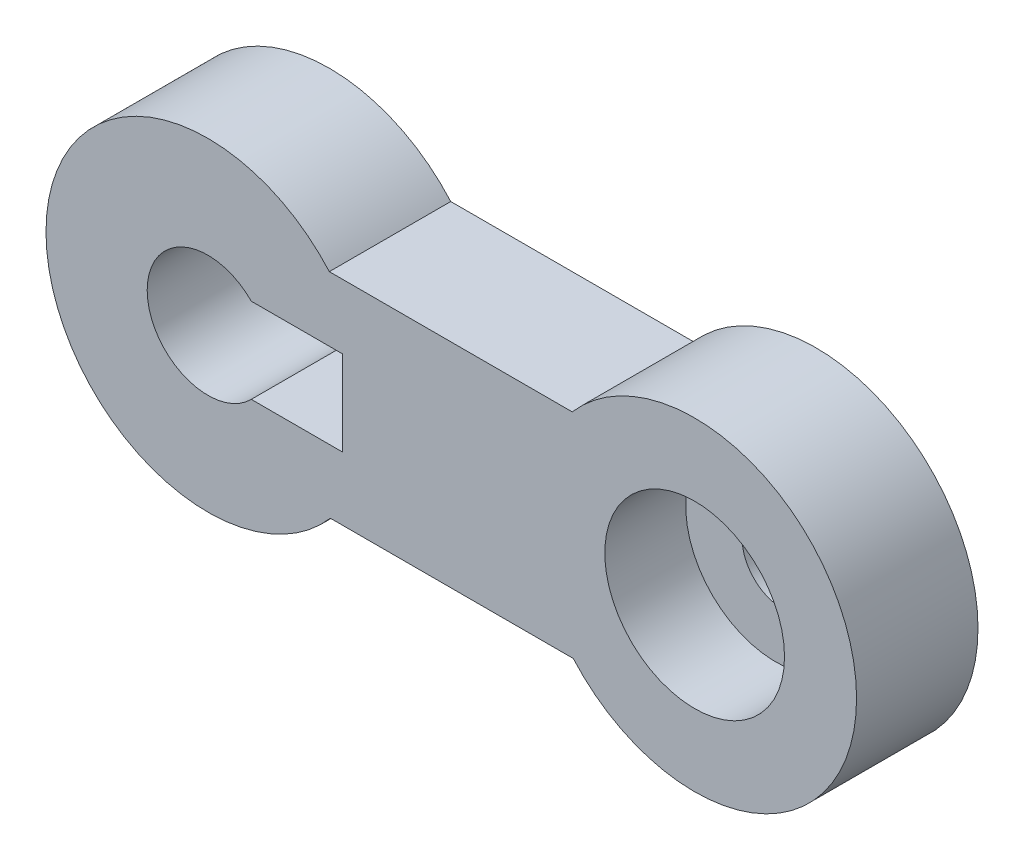
ISO-10303-21;
HEADER;
FILE_DESCRIPTION(('STEP AP214'),'2;1');
FILE_NAME('part.step','',(''),(''),'','','');
FILE_SCHEMA(('AUTOMOTIVE_DESIGN { 1 0 10303 214 1 1 1 1 }'));
ENDSEC;
DATA;
#1=APPLICATION_CONTEXT('core data for automotive mechanical design processes');
#2=APPLICATION_PROTOCOL_DEFINITION('international standard','automotive_design',2000,#1);
#3=PRODUCT_CONTEXT('',#1,'mechanical');
#4=PRODUCT('Part','Part','',(#3));
#5=PRODUCT_RELATED_PRODUCT_CATEGORY('part','',(#4));
#6=PRODUCT_DEFINITION_FORMATION('','',#4);
#7=PRODUCT_DEFINITION_CONTEXT('part definition',#1,'design');
#8=PRODUCT_DEFINITION('design','',#6,#7);
#9=PRODUCT_DEFINITION_SHAPE('','',#8);
#10=(LENGTH_UNIT() NAMED_UNIT(*) SI_UNIT(.MILLI.,.METRE.));
#11=(NAMED_UNIT(*) PLANE_ANGLE_UNIT() SI_UNIT($,.RADIAN.));
#12=(NAMED_UNIT(*) SI_UNIT($,.STERADIAN.) SOLID_ANGLE_UNIT());
#13=UNCERTAINTY_MEASURE_WITH_UNIT(LENGTH_MEASURE(1.E-05),#10,'distance_accuracy_value','');
#14=(GEOMETRIC_REPRESENTATION_CONTEXT(3) GLOBAL_UNCERTAINTY_ASSIGNED_CONTEXT((#13)) GLOBAL_UNIT_ASSIGNED_CONTEXT((#10,
#11,#12)) REPRESENTATION_CONTEXT('',''));
#15=CARTESIAN_POINT('',(0.,0.,0.));
#16=DIRECTION('',(0.,0.,1.));
#17=DIRECTION('',(1.,0.,0.));
#18=AXIS2_PLACEMENT_3D('',#15,#16,#17);
#19=CARTESIAN_POINT('',(13.1627788745223,10.6682562803249,15.));
#20=DIRECTION('',(0.,0.,-1.));
#21=DIRECTION('',(-1.,0.,0.));
#22=AXIS2_PLACEMENT_3D('',#19,#20,#21);
#23=CYLINDRICAL_SURFACE('',#22,20.);
#24=CARTESIAN_POINT('',(13.1627788745223,10.6682562803249,0.));
#25=DIRECTION('',(0.,0.,1.));
#26=DIRECTION('',(1.,0.,0.));
#27=AXIS2_PLACEMENT_3D('',#24,#25,#26);
#28=CIRCLE('',#27,20.);
#29=CARTESIAN_POINT('',(-1.83399023976093,-2.56416285348733,0.));
#30=VERTEX_POINT('',#29);
#31=CARTESIAN_POINT('',(-1.96419770871335,23.7516266201969,0.));
#32=VERTEX_POINT('',#31);
#33=EDGE_CURVE('E141',#30,#32,#28,.T.);
#34=ORIENTED_EDGE('',*,*,#33,.T.);
#35=DIRECTION('',(0.,0.,-1.));
#36=VECTOR('',#35,1.);
#37=CARTESIAN_POINT('',(-1.96419770871335,23.7516266201969,15.));
#38=LINE('',#37,#36);
#39=CARTESIAN_POINT('',(-1.96419770871335,23.7516266201969,15.));
#40=VERTEX_POINT('',#39);
#41=EDGE_CURVE('E11',#40,#32,#38,.T.);
#42=ORIENTED_EDGE('',*,*,#41,.F.);
#43=CARTESIAN_POINT('',(13.1627788745223,10.6682562803249,15.));
#44=DIRECTION('',(0.,0.,1.));
#45=DIRECTION('',(1.,0.,0.));
#46=AXIS2_PLACEMENT_3D('',#43,#44,#45);
#47=CIRCLE('',#46,20.);
#48=CARTESIAN_POINT('',(-1.83399023976093,-2.56416285348733,15.));
#49=VERTEX_POINT('',#48);
#50=EDGE_CURVE('E144',#49,#40,#47,.T.);
#51=ORIENTED_EDGE('',*,*,#50,.F.);
#52=DIRECTION('',(0.,0.,-1.));
#53=VECTOR('',#52,1.);
#54=CARTESIAN_POINT('',(-1.83399023976093,-2.56416285348733,15.));
#55=LINE('',#54,#53);
#56=EDGE_CURVE('E154',#49,#30,#55,.T.);
#57=ORIENTED_EDGE('',*,*,#56,.T.);
#58=EDGE_LOOP('',(#34,#42,#51,#57));
#59=FACE_BOUND('',#58,.T.);
#60=ADVANCED_FACE('F33',(#59),#23,.T.);
#61=CARTESIAN_POINT('',(-31.9641977087134,23.7516266201969,15.));
#62=DIRECTION('',(0.,-1.,0.));
#63=DIRECTION('',(0.,0.,-1.));
#64=AXIS2_PLACEMENT_3D('',#61,#62,#63);
#65=PLANE('',#64);
#66=DIRECTION('',(-1.,0.,0.));
#67=VECTOR('',#66,1.);
#68=CARTESIAN_POINT('',(-31.9641977087134,23.7516266201969,0.));
#69=LINE('',#68,#67);
#70=CARTESIAN_POINT('',(-31.9641977087134,23.7516266201969,0.));
#71=VERTEX_POINT('',#70);
#72=EDGE_CURVE('E157',#32,#71,#69,.T.);
#73=ORIENTED_EDGE('',*,*,#72,.T.);
#74=DIRECTION('',(0.,0.,-1.));
#75=VECTOR('',#74,1.);
#76=CARTESIAN_POINT('',(-31.9641977087134,23.7516266201969,15.));
#77=LINE('',#76,#75);
#78=CARTESIAN_POINT('',(-31.9641977087134,23.7516266201969,15.));
#79=VERTEX_POINT('',#78);
#80=EDGE_CURVE('E40',#79,#71,#77,.T.);
#81=ORIENTED_EDGE('',*,*,#80,.F.);
#82=DIRECTION('',(-1.,0.,0.));
#83=VECTOR('',#82,1.);
#84=CARTESIAN_POINT('',(-31.9641977087134,23.7516266201969,15.));
#85=LINE('',#84,#83);
#86=EDGE_CURVE('E147',#40,#79,#85,.T.);
#87=ORIENTED_EDGE('',*,*,#86,.F.);
#88=ORIENTED_EDGE('',*,*,#41,.T.);
#89=EDGE_LOOP('',(#73,#81,#87,#88));
#90=FACE_BOUND('',#89,.T.);
#91=ADVANCED_FACE('F186',(#90),#65,.F.);
#92=CARTESIAN_POINT('',(-46.9609668229966,10.5192074863846,15.));
#93=DIRECTION('',(0.,0.,-1.));
#94=DIRECTION('',(-1.,0.,0.));
#95=AXIS2_PLACEMENT_3D('',#92,#93,#94);
#96=CYLINDRICAL_SURFACE('',#95,20.);
#97=CARTESIAN_POINT('',(-46.9609668229966,10.5192074863846,0.));
#98=DIRECTION('',(0.,0.,1.));
#99=DIRECTION('',(1.,0.,0.));
#100=AXIS2_PLACEMENT_3D('',#97,#98,#99);
#101=CIRCLE('',#100,20.);
#102=CARTESIAN_POINT('',(-31.8339902397609,-2.56416285348733,0.));
#103=VERTEX_POINT('',#102);
#104=EDGE_CURVE('E159',#71,#103,#101,.T.);
#105=ORIENTED_EDGE('',*,*,#104,.T.);
#106=DIRECTION('',(0.,0.,-1.));
#107=VECTOR('',#106,1.);
#108=CARTESIAN_POINT('',(-31.8339902397609,-2.56416285348733,15.));
#109=LINE('',#108,#107);
#110=CARTESIAN_POINT('',(-31.8339902397609,-2.56416285348733,15.));
#111=VERTEX_POINT('',#110);
#112=EDGE_CURVE('E164',#111,#103,#109,.T.);
#113=ORIENTED_EDGE('',*,*,#112,.F.);
#114=CARTESIAN_POINT('',(-46.9609668229966,10.5192074863846,15.));
#115=DIRECTION('',(0.,0.,1.));
#116=DIRECTION('',(1.,0.,0.));
#117=AXIS2_PLACEMENT_3D('',#114,#115,#116);
#118=CIRCLE('',#117,20.);
#119=EDGE_CURVE('E150',#79,#111,#118,.T.);
#120=ORIENTED_EDGE('',*,*,#119,.F.);
#121=ORIENTED_EDGE('',*,*,#80,.T.);
#122=EDGE_LOOP('',(#105,#113,#120,#121));
#123=FACE_BOUND('',#122,.T.);
#124=ADVANCED_FACE('F171',(#123),#96,.T.);
#125=CARTESIAN_POINT('',(-31.8339902397609,-2.56416285348733,15.));
#126=DIRECTION('',(0.,1.,0.));
#127=DIRECTION('',(0.,0.,1.));
#128=AXIS2_PLACEMENT_3D('',#125,#126,#127);
#129=PLANE('',#128);
#130=DIRECTION('',(1.,0.,0.));
#131=VECTOR('',#130,1.);
#132=CARTESIAN_POINT('',(-31.8339902397609,-2.56416285348733,0.));
#133=LINE('',#132,#131);
#134=EDGE_CURVE('E148',#103,#30,#133,.T.);
#135=ORIENTED_EDGE('',*,*,#134,.T.);
#136=ORIENTED_EDGE('',*,*,#56,.F.);
#137=DIRECTION('',(1.,0.,0.));
#138=VECTOR('',#137,1.);
#139=CARTESIAN_POINT('',(-31.8339902397609,-2.56416285348733,15.));
#140=LINE('',#139,#138);
#141=EDGE_CURVE('E152',#111,#49,#140,.T.);
#142=ORIENTED_EDGE('',*,*,#141,.F.);
#143=ORIENTED_EDGE('',*,*,#112,.T.);
#144=EDGE_LOOP('',(#135,#136,#142,#143));
#145=FACE_BOUND('',#144,.T.);
#146=ADVANCED_FACE('F180',(#145),#129,.F.);
#147=CARTESIAN_POINT('',(13.1627788745223,10.6682562803249,15.));
#148=DIRECTION('',(0.,0.,1.));
#149=DIRECTION('',(1.,0.,0.));
#150=AXIS2_PLACEMENT_3D('',#147,#148,#149);
#151=PLANE('',#150);
#152=CARTESIAN_POINT('',(-46.9609668229966,10.5192074863846,15.));
#153=DIRECTION('',(0.,0.,-1.));
#154=DIRECTION('',(-1.,0.,0.));
#155=AXIS2_PLACEMENT_3D('',#152,#153,#154);
#156=CIRCLE('',#155,7.5);
#157=CARTESIAN_POINT('',(-41.6048955015894,5.26920748638461,15.));
#158=VERTEX_POINT('',#157);
#159=CARTESIAN_POINT('',(-41.6048955015894,15.7692074863846,15.));
#160=VERTEX_POINT('',#159);
#161=EDGE_CURVE('E99',#158,#160,#156,.T.);
#162=ORIENTED_EDGE('',*,*,#161,.T.);
#163=DIRECTION('',(1.,0.,0.));
#164=VECTOR('',#163,1.);
#165=CARTESIAN_POINT('',(0.,15.7692074863846,15.));
#166=LINE('',#165,#164);
#167=CARTESIAN_POINT('',(-30.3309020286335,15.7692074863846,15.));
#168=VERTEX_POINT('',#167);
#169=EDGE_CURVE('E105',#160,#168,#166,.T.);
#170=ORIENTED_EDGE('',*,*,#169,.T.);
#171=DIRECTION('',(0.,1.,0.));
#172=VECTOR('',#171,1.);
#173=CARTESIAN_POINT('',(-30.3309020286335,0.,15.));
#174=LINE('',#173,#172);
#175=CARTESIAN_POINT('',(-30.3309020286335,5.26920748638461,15.));
#176=VERTEX_POINT('',#175);
#177=EDGE_CURVE('E109',#176,#168,#174,.T.);
#178=ORIENTED_EDGE('',*,*,#177,.F.);
#179=DIRECTION('',(1.,0.,0.));
#180=VECTOR('',#179,1.);
#181=CARTESIAN_POINT('',(0.,5.26920748638461,15.));
#182=LINE('',#181,#180);
#183=EDGE_CURVE('E102',#158,#176,#182,.T.);
#184=ORIENTED_EDGE('',*,*,#183,.F.);
#185=EDGE_LOOP('',(#162,#170,#178,#184));
#186=FACE_BOUND('',#185,.T.);
#187=CARTESIAN_POINT('',(13.1627788745223,10.6682562803249,15.));
#188=DIRECTION('',(0.,0.,1.));
#189=DIRECTION('',(1.,0.,0.));
#190=AXIS2_PLACEMENT_3D('',#187,#188,#189);
#191=CIRCLE('',#190,11.1);
#192=CARTESIAN_POINT('',(24.2627788745223,10.6682562803249,15.));
#193=VERTEX_POINT('',#192);
#194=EDGE_CURVE('E137',#193,#193,#191,.T.);
#195=ORIENTED_EDGE('',*,*,#194,.F.);
#196=EDGE_LOOP('',(#195));
#197=FACE_BOUND('',#196,.T.);
#198=ORIENTED_EDGE('',*,*,#50,.T.);
#199=ORIENTED_EDGE('',*,*,#86,.T.);
#200=ORIENTED_EDGE('',*,*,#119,.T.);
#201=ORIENTED_EDGE('',*,*,#141,.T.);
#202=EDGE_LOOP('',(#198,#199,#200,#201));
#203=FACE_BOUND('',#202,.T.);
#204=ADVANCED_FACE('F111',(#186,#197,#203),#151,.T.);
#205=CARTESIAN_POINT('',(13.1627788745223,10.6682562803249,0.));
#206=DIRECTION('',(0.,0.,1.));
#207=DIRECTION('',(1.,0.,0.));
#208=AXIS2_PLACEMENT_3D('',#205,#206,#207);
#209=PLANE('',#208);
#210=DIRECTION('',(1.,0.,0.));
#211=VECTOR('',#210,1.);
#212=CARTESIAN_POINT('',(0.,15.7692074863846,0.));
#213=LINE('',#212,#211);
#214=CARTESIAN_POINT('',(-41.6048955015894,15.7692074863846,0.));
#215=VERTEX_POINT('',#214);
#216=CARTESIAN_POINT('',(-30.3309020286335,15.7692074863846,0.));
#217=VERTEX_POINT('',#216);
#218=EDGE_CURVE('E122',#215,#217,#213,.T.);
#219=ORIENTED_EDGE('',*,*,#218,.F.);
#220=CARTESIAN_POINT('',(-46.9609668229966,10.5192074863846,0.));
#221=DIRECTION('',(0.,0.,-1.));
#222=DIRECTION('',(-1.,0.,0.));
#223=AXIS2_PLACEMENT_3D('',#220,#221,#222);
#224=CIRCLE('',#223,7.5);
#225=CARTESIAN_POINT('',(-41.6048955015894,5.26920748638461,0.));
#226=VERTEX_POINT('',#225);
#227=EDGE_CURVE('E55',#226,#215,#224,.T.);
#228=ORIENTED_EDGE('',*,*,#227,.F.);
#229=DIRECTION('',(1.,0.,0.));
#230=VECTOR('',#229,1.);
#231=CARTESIAN_POINT('',(0.,5.26920748638461,0.));
#232=LINE('',#231,#230);
#233=CARTESIAN_POINT('',(-30.3309020286335,5.26920748638461,0.));
#234=VERTEX_POINT('',#233);
#235=EDGE_CURVE('E113',#226,#234,#232,.T.);
#236=ORIENTED_EDGE('',*,*,#235,.T.);
#237=DIRECTION('',(0.,1.,0.));
#238=VECTOR('',#237,1.);
#239=CARTESIAN_POINT('',(-30.3309020286335,0.,0.));
#240=LINE('',#239,#238);
#241=EDGE_CURVE('E116',#234,#217,#240,.T.);
#242=ORIENTED_EDGE('',*,*,#241,.T.);
#243=EDGE_LOOP('',(#219,#228,#236,#242));
#244=FACE_BOUND('',#243,.T.);
#245=CARTESIAN_POINT('',(14.030645460231,10.6682562803249,0.));
#246=DIRECTION('',(0.,0.,1.));
#247=DIRECTION('',(1.,0.,0.));
#248=AXIS2_PLACEMENT_3D('',#245,#246,#247);
#249=CIRCLE('',#248,5.);
#250=CARTESIAN_POINT('',(19.030645460231,10.6682562803249,0.));
#251=VERTEX_POINT('',#250);
#252=EDGE_CURVE('E134',#251,#251,#249,.T.);
#253=ORIENTED_EDGE('',*,*,#252,.T.);
#254=EDGE_LOOP('',(#253));
#255=FACE_BOUND('',#254,.T.);
#256=ORIENTED_EDGE('',*,*,#33,.F.);
#257=ORIENTED_EDGE('',*,*,#134,.F.);
#258=ORIENTED_EDGE('',*,*,#104,.F.);
#259=ORIENTED_EDGE('',*,*,#72,.F.);
#260=EDGE_LOOP('',(#256,#257,#258,#259));
#261=FACE_BOUND('',#260,.T.);
#262=ADVANCED_FACE('F177',(#244,#255,#261),#209,.F.);
#263=CARTESIAN_POINT('',(13.1627788745223,10.6682562803249,5.));
#264=DIRECTION('',(0.,0.,1.));
#265=DIRECTION('',(1.,0.,0.));
#266=AXIS2_PLACEMENT_3D('',#263,#264,#265);
#267=CYLINDRICAL_SURFACE('',#266,11.1);
#268=CARTESIAN_POINT('',(13.1627788745223,10.6682562803249,5.));
#269=DIRECTION('',(0.,0.,1.));
#270=DIRECTION('',(1.,0.,0.));
#271=AXIS2_PLACEMENT_3D('',#268,#269,#270);
#272=CIRCLE('',#271,11.1);
#273=CARTESIAN_POINT('',(24.2627788745223,10.6682562803249,5.));
#274=VERTEX_POINT('',#273);
#275=EDGE_CURVE('E138',#274,#274,#272,.T.);
#276=ORIENTED_EDGE('',*,*,#275,.F.);
#277=EDGE_LOOP('',(#276));
#278=FACE_BOUND('',#277,.T.);
#279=ORIENTED_EDGE('',*,*,#194,.T.);
#280=EDGE_LOOP('',(#279));
#281=FACE_BOUND('',#280,.T.);
#282=ADVANCED_FACE('F198',(#278,#281),#267,.F.);
#283=CARTESIAN_POINT('',(13.1627788745223,10.6682562803249,5.));
#284=DIRECTION('',(0.,0.,1.));
#285=DIRECTION('',(1.,0.,0.));
#286=AXIS2_PLACEMENT_3D('',#283,#284,#285);
#287=PLANE('',#286);
#288=CARTESIAN_POINT('',(14.030645460231,10.6682562803249,5.));
#289=DIRECTION('',(0.,0.,1.));
#290=DIRECTION('',(1.,0.,0.));
#291=AXIS2_PLACEMENT_3D('',#288,#289,#290);
#292=CIRCLE('',#291,5.);
#293=CARTESIAN_POINT('',(19.030645460231,10.6682562803249,5.));
#294=VERTEX_POINT('',#293);
#295=EDGE_CURVE('E128',#294,#294,#292,.T.);
#296=ORIENTED_EDGE('',*,*,#295,.F.);
#297=EDGE_LOOP('',(#296));
#298=FACE_BOUND('',#297,.T.);
#299=ORIENTED_EDGE('',*,*,#275,.T.);
#300=EDGE_LOOP('',(#299));
#301=FACE_BOUND('',#300,.T.);
#302=ADVANCED_FACE('F204',(#298,#301),#287,.T.);
#303=CARTESIAN_POINT('',(14.030645460231,10.6682562803249,-5.));
#304=DIRECTION('',(0.,0.,1.));
#305=DIRECTION('',(1.,0.,0.));
#306=AXIS2_PLACEMENT_3D('',#303,#304,#305);
#307=CYLINDRICAL_SURFACE('',#306,5.);
#308=ORIENTED_EDGE('',*,*,#295,.T.);
#309=EDGE_LOOP('',(#308));
#310=FACE_BOUND('',#309,.T.);
#311=ORIENTED_EDGE('',*,*,#252,.F.);
#312=EDGE_LOOP('',(#311));
#313=FACE_BOUND('',#312,.T.);
#314=ADVANCED_FACE('F208',(#310,#313),#307,.F.);
#315=CARTESIAN_POINT('',(-46.9609668229966,10.5192074863846,15.));
#316=DIRECTION('',(0.,0.,-1.));
#317=DIRECTION('',(-1.,0.,0.));
#318=AXIS2_PLACEMENT_3D('',#315,#316,#317);
#319=CYLINDRICAL_SURFACE('',#318,7.5);
#320=ORIENTED_EDGE('',*,*,#227,.T.);
#321=DIRECTION('',(0.,0.,-1.));
#322=VECTOR('',#321,1.);
#323=CARTESIAN_POINT('',(-41.6048955015894,15.7692074863846,15.));
#324=LINE('',#323,#322);
#325=EDGE_CURVE('E96',#160,#215,#324,.T.);
#326=ORIENTED_EDGE('',*,*,#325,.F.);
#327=ORIENTED_EDGE('',*,*,#161,.F.);
#328=DIRECTION('',(0.,0.,-1.));
#329=VECTOR('',#328,1.);
#330=CARTESIAN_POINT('',(-41.6048955015894,5.26920748638461,15.));
#331=LINE('',#330,#329);
#332=EDGE_CURVE('E126',#158,#226,#331,.T.);
#333=ORIENTED_EDGE('',*,*,#332,.T.);
#334=EDGE_LOOP('',(#320,#326,#327,#333));
#335=FACE_BOUND('',#334,.T.);
#336=ADVANCED_FACE('F97',(#335),#319,.F.);
#337=CARTESIAN_POINT('',(0.,5.26920748638461,15.));
#338=DIRECTION('',(0.,1.,0.));
#339=DIRECTION('',(-1.,0.,0.));
#340=AXIS2_PLACEMENT_3D('',#337,#338,#339);
#341=PLANE('',#340);
#342=ORIENTED_EDGE('',*,*,#235,.F.);
#343=ORIENTED_EDGE('',*,*,#332,.F.);
#344=ORIENTED_EDGE('',*,*,#183,.T.);
#345=DIRECTION('',(0.,0.,-1.));
#346=VECTOR('',#345,1.);
#347=CARTESIAN_POINT('',(-30.3309020286335,5.26920748638461,15.));
#348=LINE('',#347,#346);
#349=EDGE_CURVE('E129',#176,#234,#348,.T.);
#350=ORIENTED_EDGE('',*,*,#349,.T.);
#351=EDGE_LOOP('',(#342,#343,#344,#350));
#352=FACE_BOUND('',#351,.T.);
#353=ADVANCED_FACE('F215',(#352),#341,.T.);
#354=CARTESIAN_POINT('',(-30.3309020286335,0.,15.));
#355=DIRECTION('',(-1.,0.,0.));
#356=DIRECTION('',(0.,0.,1.));
#357=AXIS2_PLACEMENT_3D('',#354,#355,#356);
#358=PLANE('',#357);
#359=ORIENTED_EDGE('',*,*,#241,.F.);
#360=ORIENTED_EDGE('',*,*,#349,.F.);
#361=ORIENTED_EDGE('',*,*,#177,.T.);
#362=DIRECTION('',(0.,0.,-1.));
#363=VECTOR('',#362,1.);
#364=CARTESIAN_POINT('',(-30.3309020286335,15.7692074863846,15.));
#365=LINE('',#364,#363);
#366=EDGE_CURVE('E47',#168,#217,#365,.T.);
#367=ORIENTED_EDGE('',*,*,#366,.T.);
#368=EDGE_LOOP('',(#359,#360,#361,#367));
#369=FACE_BOUND('',#368,.T.);
#370=ADVANCED_FACE('F218',(#369),#358,.T.);
#371=CARTESIAN_POINT('',(0.,15.7692074863846,15.));
#372=DIRECTION('',(0.,1.,0.));
#373=DIRECTION('',(0.,0.,1.));
#374=AXIS2_PLACEMENT_3D('',#371,#372,#373);
#375=PLANE('',#374);
#376=ORIENTED_EDGE('',*,*,#218,.T.);
#377=ORIENTED_EDGE('',*,*,#366,.F.);
#378=ORIENTED_EDGE('',*,*,#169,.F.);
#379=ORIENTED_EDGE('',*,*,#325,.T.);
#380=EDGE_LOOP('',(#376,#377,#378,#379));
#381=FACE_BOUND('',#380,.T.);
#382=ADVANCED_FACE('F106',(#381),#375,.F.);
#383=CLOSED_SHELL('',(#60,#91,#124,#146,#204,#262,#282,#302,#314,#336,#353,#370,#382));
#384=MANIFOLD_SOLID_BREP('B2',#383);
#385=ADVANCED_BREP_SHAPE_REPRESENTATION('',(#18,#384),#14);
#386=SHAPE_DEFINITION_REPRESENTATION(#9,#385);
ENDSEC;
END-ISO-10303-21;
